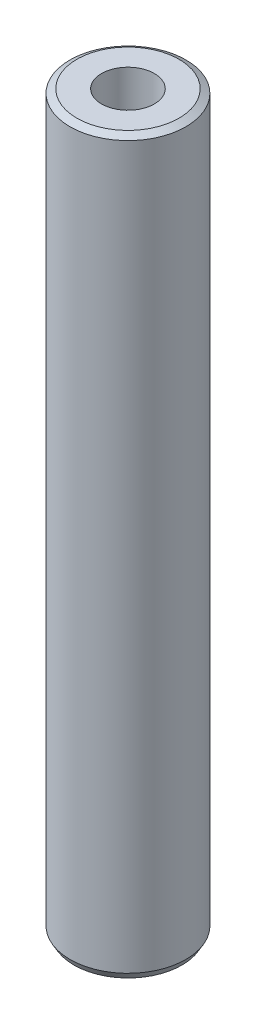
ISO-10303-21;
HEADER;
FILE_DESCRIPTION(('STEP AP214'),'2;1');
FILE_NAME('part.step','',(''),(''),'','','');
FILE_SCHEMA(('AUTOMOTIVE_DESIGN { 1 0 10303 214 1 1 1 1 }'));
ENDSEC;
DATA;
#1=APPLICATION_CONTEXT('core data for automotive mechanical design processes');
#2=APPLICATION_PROTOCOL_DEFINITION('international standard','automotive_design',2000,#1);
#3=PRODUCT_CONTEXT('',#1,'mechanical');
#4=PRODUCT('Part','Part','',(#3));
#5=PRODUCT_RELATED_PRODUCT_CATEGORY('part','',(#4));
#6=PRODUCT_DEFINITION_FORMATION('','',#4);
#7=PRODUCT_DEFINITION_CONTEXT('part definition',#1,'design');
#8=PRODUCT_DEFINITION('design','',#6,#7);
#9=PRODUCT_DEFINITION_SHAPE('','',#8);
#10=(LENGTH_UNIT() NAMED_UNIT(*) SI_UNIT(.MILLI.,.METRE.));
#11=(NAMED_UNIT(*) PLANE_ANGLE_UNIT() SI_UNIT($,.RADIAN.));
#12=(NAMED_UNIT(*) SI_UNIT($,.STERADIAN.) SOLID_ANGLE_UNIT());
#13=UNCERTAINTY_MEASURE_WITH_UNIT(LENGTH_MEASURE(1.E-05),#10,'distance_accuracy_value','');
#14=(GEOMETRIC_REPRESENTATION_CONTEXT(3) GLOBAL_UNCERTAINTY_ASSIGNED_CONTEXT((#13)) GLOBAL_UNIT_ASSIGNED_CONTEXT((#10,
#11,#12)) REPRESENTATION_CONTEXT('',''));
#15=CARTESIAN_POINT('',(0.,0.,0.));
#16=DIRECTION('',(0.,0.,1.));
#17=DIRECTION('',(1.,0.,0.));
#18=AXIS2_PLACEMENT_3D('',#15,#16,#17);
#19=CARTESIAN_POINT('',(0.,600.,0.));
#20=DIRECTION('',(0.,-1.,0.));
#21=DIRECTION('',(0.,0.,-1.));
#22=AXIS2_PLACEMENT_3D('',#19,#20,#21);
#23=CYLINDRICAL_SURFACE('',#22,47.5);
#24=CARTESIAN_POINT('',(0.,596.744303710913,0.));
#25=DIRECTION('',(0.,1.,0.));
#26=DIRECTION('',(0.,0.,1.));
#27=AXIS2_PLACEMENT_3D('',#24,#25,#26);
#28=CIRCLE('',#27,47.5);
#29=CARTESIAN_POINT('',(0.,596.744303710913,47.5));
#30=VERTEX_POINT('',#29);
#31=EDGE_CURVE('E50',#30,#30,#28,.F.);
#32=ORIENTED_EDGE('',*,*,#31,.T.);
#33=EDGE_LOOP('',(#32));
#34=FACE_BOUND('',#33,.T.);
#35=CARTESIAN_POINT('',(0.,5.63903138671185,0.));
#36=DIRECTION('',(0.,1.,0.));
#37=DIRECTION('',(0.,0.,1.));
#38=AXIS2_PLACEMENT_3D('',#35,#36,#37);
#39=CIRCLE('',#38,47.5);
#40=CARTESIAN_POINT('',(0.,5.63903138671185,47.5));
#41=VERTEX_POINT('',#40);
#42=EDGE_CURVE('E51',#41,#41,#39,.T.);
#43=ORIENTED_EDGE('',*,*,#42,.T.);
#44=EDGE_LOOP('',(#43));
#45=FACE_BOUND('',#44,.T.);
#46=ADVANCED_FACE('F39',(#34,#45),#23,.T.);
#47=CARTESIAN_POINT('',(0.,600.,0.));
#48=DIRECTION('',(0.,1.,0.));
#49=DIRECTION('',(0.,0.,1.));
#50=AXIS2_PLACEMENT_3D('',#47,#48,#49);
#51=PLANE('',#50);
#52=CARTESIAN_POINT('',(0.,600.,0.));
#53=DIRECTION('',(0.,1.,0.));
#54=DIRECTION('',(0.,0.,1.));
#55=AXIS2_PLACEMENT_3D('',#52,#53,#54);
#56=CIRCLE('',#55,41.860968613288);
#57=CARTESIAN_POINT('',(0.,600.,41.860968613288));
#58=VERTEX_POINT('',#57);
#59=EDGE_CURVE('E54',#58,#58,#56,.T.);
#60=ORIENTED_EDGE('',*,*,#59,.T.);
#61=EDGE_LOOP('',(#60));
#62=FACE_BOUND('',#61,.T.);
#63=CARTESIAN_POINT('',(0.,600.,0.));
#64=DIRECTION('',(0.,1.,0.));
#65=DIRECTION('',(0.,0.,1.));
#66=AXIS2_PLACEMENT_3D('',#63,#64,#65);
#67=CIRCLE('',#66,21.6402572059848);
#68=CARTESIAN_POINT('',(0.,600.,21.6402572059848));
#69=VERTEX_POINT('',#68);
#70=EDGE_CURVE('E58',#69,#69,#67,.T.);
#71=ORIENTED_EDGE('',*,*,#70,.F.);
#72=EDGE_LOOP('',(#71));
#73=FACE_BOUND('',#72,.T.);
#74=ADVANCED_FACE('F69',(#62,#73),#51,.T.);
#75=CARTESIAN_POINT('',(0.,0.,0.));
#76=DIRECTION('',(0.,1.,0.));
#77=DIRECTION('',(0.,0.,1.));
#78=AXIS2_PLACEMENT_3D('',#75,#76,#77);
#79=PLANE('',#78);
#80=CARTESIAN_POINT('',(0.,0.,0.));
#81=DIRECTION('',(0.,1.,0.));
#82=DIRECTION('',(0.,0.,1.));
#83=AXIS2_PLACEMENT_3D('',#80,#81,#82);
#84=CIRCLE('',#83,44.2443037109131);
#85=CARTESIAN_POINT('',(0.,0.,44.2443037109131));
#86=VERTEX_POINT('',#85);
#87=EDGE_CURVE('E10',#86,#86,#84,.F.);
#88=ORIENTED_EDGE('',*,*,#87,.T.);
#89=EDGE_LOOP('',(#88));
#90=FACE_BOUND('',#89,.T.);
#91=CARTESIAN_POINT('',(0.,0.,0.));
#92=DIRECTION('',(0.,1.,0.));
#93=DIRECTION('',(0.,0.,1.));
#94=AXIS2_PLACEMENT_3D('',#91,#92,#93);
#95=CIRCLE('',#94,21.6402572059848);
#96=CARTESIAN_POINT('',(0.,0.,21.6402572059848));
#97=VERTEX_POINT('',#96);
#98=EDGE_CURVE('E63',#97,#97,#95,.T.);
#99=ORIENTED_EDGE('',*,*,#98,.T.);
#100=EDGE_LOOP('',(#99));
#101=FACE_BOUND('',#100,.T.);
#102=ADVANCED_FACE('F75',(#90,#101),#79,.F.);
#103=CARTESIAN_POINT('',(0.,600.,0.));
#104=DIRECTION('',(0.,-1.,0.));
#105=DIRECTION('',(0.,0.,-1.));
#106=AXIS2_PLACEMENT_3D('',#103,#104,#105);
#107=CYLINDRICAL_SURFACE('',#106,21.6402572059848);
#108=ORIENTED_EDGE('',*,*,#70,.T.);
#109=EDGE_LOOP('',(#108));
#110=FACE_BOUND('',#109,.T.);
#111=ORIENTED_EDGE('',*,*,#98,.F.);
#112=EDGE_LOOP('',(#111));
#113=FACE_BOUND('',#112,.T.);
#114=ADVANCED_FACE('F70',(#110,#113),#107,.F.);
#115=CARTESIAN_POINT('',(0.,600.,0.));
#116=DIRECTION('',(0.,-1.,0.));
#117=DIRECTION('',(0.,0.,-1.));
#118=AXIS2_PLACEMENT_3D('',#115,#116,#117);
#119=CONICAL_SURFACE('',#118,41.860968613288,1.04719755119659);
#120=ORIENTED_EDGE('',*,*,#31,.F.);
#121=EDGE_LOOP('',(#120));
#122=FACE_BOUND('',#121,.T.);
#123=ORIENTED_EDGE('',*,*,#59,.F.);
#124=EDGE_LOOP('',(#123));
#125=FACE_BOUND('',#124,.T.);
#126=ADVANCED_FACE('F81',(#122,#125),#119,.T.);
#127=CARTESIAN_POINT('',(0.,5.63903138671185,0.));
#128=DIRECTION('',(0.,1.,0.));
#129=DIRECTION('',(0.,0.,1.));
#130=AXIS2_PLACEMENT_3D('',#127,#128,#129);
#131=CONICAL_SURFACE('',#130,47.5,0.523598775598303);
#132=ORIENTED_EDGE('',*,*,#87,.F.);
#133=EDGE_LOOP('',(#132));
#134=FACE_BOUND('',#133,.T.);
#135=ORIENTED_EDGE('',*,*,#42,.F.);
#136=EDGE_LOOP('',(#135));
#137=FACE_BOUND('',#136,.T.);
#138=ADVANCED_FACE('F45',(#134,#137),#131,.T.);
#139=CLOSED_SHELL('',(#46,#74,#102,#114,#126,#138));
#140=MANIFOLD_SOLID_BREP('B2',#139);
#141=ADVANCED_BREP_SHAPE_REPRESENTATION('',(#18,#140),#14);
#142=SHAPE_DEFINITION_REPRESENTATION(#9,#141);
ENDSEC;
END-ISO-10303-21;
